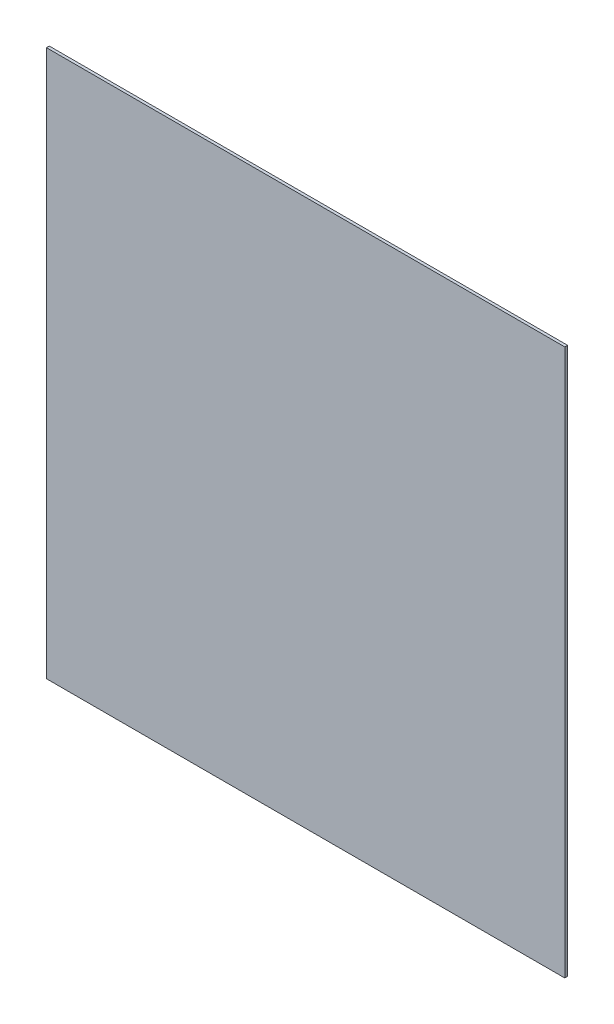
ISO-10303-21;
HEADER;
FILE_DESCRIPTION(('STEP AP214'),'2;1');
FILE_NAME('part.step','',(''),(''),'','','');
FILE_SCHEMA(('AUTOMOTIVE_DESIGN { 1 0 10303 214 1 1 1 1 }'));
ENDSEC;
DATA;
#1=APPLICATION_CONTEXT('core data for automotive mechanical design processes');
#2=APPLICATION_PROTOCOL_DEFINITION('international standard','automotive_design',2000,#1);
#3=PRODUCT_CONTEXT('',#1,'mechanical');
#4=PRODUCT('Part','Part','',(#3));
#5=PRODUCT_RELATED_PRODUCT_CATEGORY('part','',(#4));
#6=PRODUCT_DEFINITION_FORMATION('','',#4);
#7=PRODUCT_DEFINITION_CONTEXT('part definition',#1,'design');
#8=PRODUCT_DEFINITION('design','',#6,#7);
#9=PRODUCT_DEFINITION_SHAPE('','',#8);
#10=(LENGTH_UNIT() NAMED_UNIT(*) SI_UNIT(.MILLI.,.METRE.));
#11=(NAMED_UNIT(*) PLANE_ANGLE_UNIT() SI_UNIT($,.RADIAN.));
#12=(NAMED_UNIT(*) SI_UNIT($,.STERADIAN.) SOLID_ANGLE_UNIT());
#13=UNCERTAINTY_MEASURE_WITH_UNIT(LENGTH_MEASURE(1.E-05),#10,'distance_accuracy_value','');
#14=(GEOMETRIC_REPRESENTATION_CONTEXT(3) GLOBAL_UNCERTAINTY_ASSIGNED_CONTEXT((#13)) GLOBAL_UNIT_ASSIGNED_CONTEXT((#10,
#11,#12)) REPRESENTATION_CONTEXT('',''));
#15=CARTESIAN_POINT('',(0.,0.,0.));
#16=DIRECTION('',(0.,0.,1.));
#17=DIRECTION('',(1.,0.,0.));
#18=AXIS2_PLACEMENT_3D('',#15,#16,#17);
#19=CARTESIAN_POINT('',(184.,194.,0.));
#20=DIRECTION('',(0.,0.,1.));
#21=DIRECTION('',(1.,0.,0.));
#22=AXIS2_PLACEMENT_3D('',#19,#20,#21);
#23=PLANE('',#22);
#24=DIRECTION('',(0.,1.,0.));
#25=VECTOR('',#24,1.);
#26=CARTESIAN_POINT('',(0.,388.,0.));
#27=LINE('',#26,#25);
#28=CARTESIAN_POINT('',(0.,388.,0.));
#29=VERTEX_POINT('',#28);
#30=CARTESIAN_POINT('',(0.,0.,0.));
#31=VERTEX_POINT('',#30);
#32=EDGE_CURVE('E88',#29,#31,#27,.F.);
#33=ORIENTED_EDGE('',*,*,#32,.F.);
#34=DIRECTION('',(1.,0.,0.));
#35=VECTOR('',#34,1.);
#36=CARTESIAN_POINT('',(368.,388.,0.));
#37=LINE('',#36,#35);
#38=CARTESIAN_POINT('',(368.,388.,0.));
#39=VERTEX_POINT('',#38);
#40=EDGE_CURVE('E56',#39,#29,#37,.F.);
#41=ORIENTED_EDGE('',*,*,#40,.F.);
#42=DIRECTION('',(0.,1.,0.));
#43=VECTOR('',#42,1.);
#44=CARTESIAN_POINT('',(368.,0.,0.));
#45=LINE('',#44,#43);
#46=CARTESIAN_POINT('',(368.,0.,0.));
#47=VERTEX_POINT('',#46);
#48=EDGE_CURVE('E58',#47,#39,#45,.T.);
#49=ORIENTED_EDGE('',*,*,#48,.F.);
#50=DIRECTION('',(1.,0.,0.));
#51=VECTOR('',#50,1.);
#52=CARTESIAN_POINT('',(0.,0.,0.));
#53=LINE('',#52,#51);
#54=EDGE_CURVE('E20',#31,#47,#53,.T.);
#55=ORIENTED_EDGE('',*,*,#54,.F.);
#56=EDGE_LOOP('',(#33,#41,#49,#55));
#57=FACE_BOUND('',#56,.T.);
#58=ADVANCED_FACE('F17',(#57),#23,.F.);
#59=CARTESIAN_POINT('',(0.,0.,0.));
#60=DIRECTION('',(0.,-1.,0.));
#61=DIRECTION('',(0.,0.,-1.));
#62=AXIS2_PLACEMENT_3D('',#59,#60,#61);
#63=PLANE('',#62);
#64=DIRECTION('',(1.,0.,0.));
#65=VECTOR('',#64,1.);
#66=CARTESIAN_POINT('',(184.,0.,2.));
#67=LINE('',#66,#65);
#68=CARTESIAN_POINT('',(0.,0.,2.));
#69=VERTEX_POINT('',#68);
#70=CARTESIAN_POINT('',(368.,0.,2.));
#71=VERTEX_POINT('',#70);
#72=EDGE_CURVE('E93',#69,#71,#67,.T.);
#73=ORIENTED_EDGE('',*,*,#72,.F.);
#74=DIRECTION('',(0.,0.,1.));
#75=VECTOR('',#74,1.);
#76=CARTESIAN_POINT('',(0.,0.,0.));
#77=LINE('',#76,#75);
#78=EDGE_CURVE('E70',#31,#69,#77,.T.);
#79=ORIENTED_EDGE('',*,*,#78,.F.);
#80=ORIENTED_EDGE('',*,*,#54,.T.);
#81=DIRECTION('',(0.,0.,-1.));
#82=VECTOR('',#81,1.);
#83=CARTESIAN_POINT('',(368.,0.,0.));
#84=LINE('',#83,#82);
#85=EDGE_CURVE('E65',#71,#47,#84,.T.);
#86=ORIENTED_EDGE('',*,*,#85,.F.);
#87=EDGE_LOOP('',(#73,#79,#80,#86));
#88=FACE_BOUND('',#87,.T.);
#89=ADVANCED_FACE('F67',(#88),#63,.T.);
#90=CARTESIAN_POINT('',(368.,0.,0.));
#91=DIRECTION('',(1.,0.,0.));
#92=DIRECTION('',(0.,0.,-1.));
#93=AXIS2_PLACEMENT_3D('',#90,#91,#92);
#94=PLANE('',#93);
#95=DIRECTION('',(0.,1.,0.));
#96=VECTOR('',#95,1.);
#97=CARTESIAN_POINT('',(368.,194.,2.));
#98=LINE('',#97,#96);
#99=CARTESIAN_POINT('',(368.,388.,2.));
#100=VERTEX_POINT('',#99);
#101=EDGE_CURVE('E75',#71,#100,#98,.T.);
#102=ORIENTED_EDGE('',*,*,#101,.F.);
#103=ORIENTED_EDGE('',*,*,#85,.T.);
#104=ORIENTED_EDGE('',*,*,#48,.T.);
#105=DIRECTION('',(0.,0.,1.));
#106=VECTOR('',#105,1.);
#107=CARTESIAN_POINT('',(368.,388.,0.));
#108=LINE('',#107,#106);
#109=EDGE_CURVE('E83',#100,#39,#108,.F.);
#110=ORIENTED_EDGE('',*,*,#109,.F.);
#111=EDGE_LOOP('',(#102,#103,#104,#110));
#112=FACE_BOUND('',#111,.T.);
#113=ADVANCED_FACE('F73',(#112),#94,.T.);
#114=CARTESIAN_POINT('',(368.,388.,0.));
#115=DIRECTION('',(0.,1.,0.));
#116=DIRECTION('',(0.,0.,1.));
#117=AXIS2_PLACEMENT_3D('',#114,#115,#116);
#118=PLANE('',#117);
#119=DIRECTION('',(1.,0.,0.));
#120=VECTOR('',#119,1.);
#121=CARTESIAN_POINT('',(184.,388.,2.));
#122=LINE('',#121,#120);
#123=CARTESIAN_POINT('',(0.,388.,2.));
#124=VERTEX_POINT('',#123);
#125=EDGE_CURVE('E27',#100,#124,#122,.F.);
#126=ORIENTED_EDGE('',*,*,#125,.F.);
#127=ORIENTED_EDGE('',*,*,#109,.T.);
#128=ORIENTED_EDGE('',*,*,#40,.T.);
#129=DIRECTION('',(0.,0.,1.));
#130=VECTOR('',#129,1.);
#131=CARTESIAN_POINT('',(0.,388.,0.));
#132=LINE('',#131,#130);
#133=EDGE_CURVE('E36',#124,#29,#132,.F.);
#134=ORIENTED_EDGE('',*,*,#133,.F.);
#135=EDGE_LOOP('',(#126,#127,#128,#134));
#136=FACE_BOUND('',#135,.T.);
#137=ADVANCED_FACE('F102',(#136),#118,.T.);
#138=CARTESIAN_POINT('',(0.,388.,0.));
#139=DIRECTION('',(-1.,0.,0.));
#140=DIRECTION('',(0.,0.,1.));
#141=AXIS2_PLACEMENT_3D('',#138,#139,#140);
#142=PLANE('',#141);
#143=DIRECTION('',(0.,1.,0.));
#144=VECTOR('',#143,1.);
#145=CARTESIAN_POINT('',(0.,194.,2.));
#146=LINE('',#145,#144);
#147=EDGE_CURVE('E11',#124,#69,#146,.F.);
#148=ORIENTED_EDGE('',*,*,#147,.F.);
#149=ORIENTED_EDGE('',*,*,#133,.T.);
#150=ORIENTED_EDGE('',*,*,#32,.T.);
#151=ORIENTED_EDGE('',*,*,#78,.T.);
#152=EDGE_LOOP('',(#148,#149,#150,#151));
#153=FACE_BOUND('',#152,.T.);
#154=ADVANCED_FACE('F104',(#153),#142,.T.);
#155=CARTESIAN_POINT('',(184.,194.,2.));
#156=DIRECTION('',(0.,0.,1.));
#157=DIRECTION('',(1.,0.,0.));
#158=AXIS2_PLACEMENT_3D('',#155,#156,#157);
#159=PLANE('',#158);
#160=ORIENTED_EDGE('',*,*,#125,.T.);
#161=ORIENTED_EDGE('',*,*,#147,.T.);
#162=ORIENTED_EDGE('',*,*,#72,.T.);
#163=ORIENTED_EDGE('',*,*,#101,.T.);
#164=EDGE_LOOP('',(#160,#161,#162,#163));
#165=FACE_BOUND('',#164,.T.);
#166=ADVANCED_FACE('F101',(#165),#159,.T.);
#167=CLOSED_SHELL('',(#58,#89,#113,#137,#154,#166));
#168=MANIFOLD_SOLID_BREP('B1',#167);
#169=ADVANCED_BREP_SHAPE_REPRESENTATION('',(#18,#168),#14);
#170=SHAPE_DEFINITION_REPRESENTATION(#9,#169);
ENDSEC;
END-ISO-10303-21;
